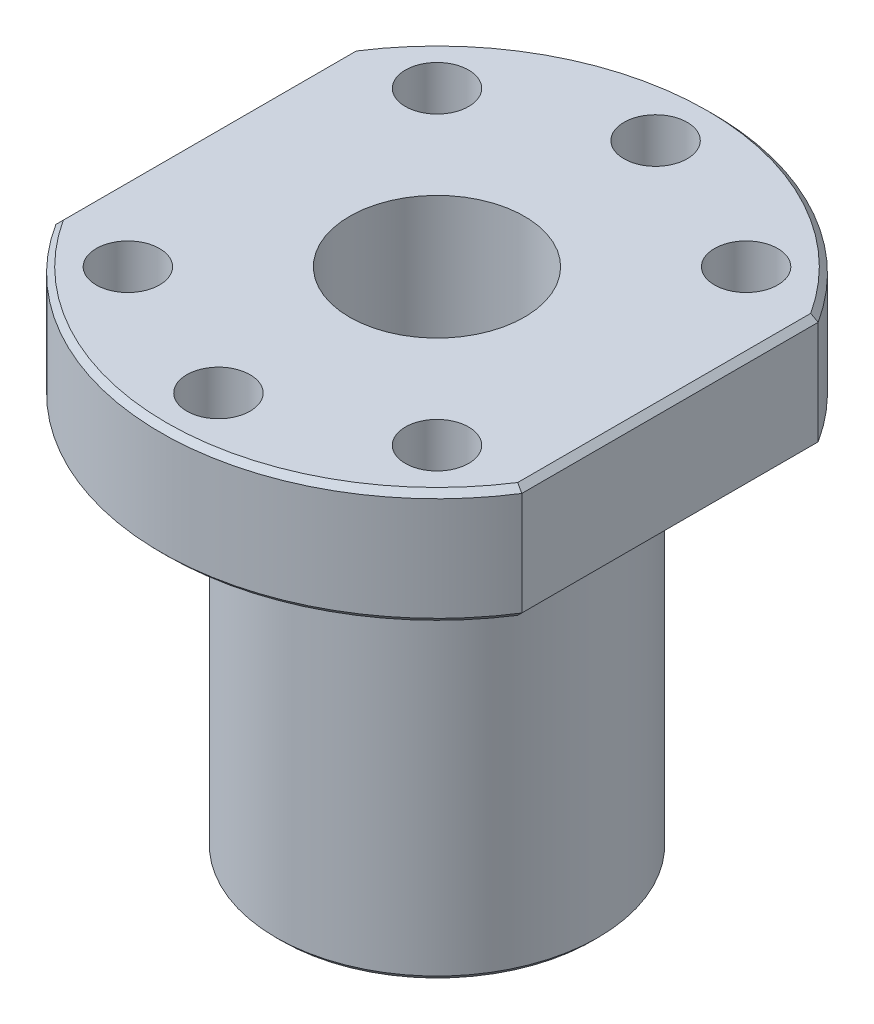
ISO-10303-21;
HEADER;
FILE_DESCRIPTION(('STEP AP214'),'2;1');
FILE_NAME('part.step','',(''),(''),'','','');
FILE_SCHEMA(('AUTOMOTIVE_DESIGN { 1 0 10303 214 1 1 1 1 }'));
ENDSEC;
DATA;
#1=APPLICATION_CONTEXT('core data for automotive mechanical design processes');
#2=APPLICATION_PROTOCOL_DEFINITION('international standard','automotive_design',2000,#1);
#3=PRODUCT_CONTEXT('',#1,'mechanical');
#4=PRODUCT('Part','Part','',(#3));
#5=PRODUCT_RELATED_PRODUCT_CATEGORY('part','',(#4));
#6=PRODUCT_DEFINITION_FORMATION('','',#4);
#7=PRODUCT_DEFINITION_CONTEXT('part definition',#1,'design');
#8=PRODUCT_DEFINITION('design','',#6,#7);
#9=PRODUCT_DEFINITION_SHAPE('','',#8);
#10=(LENGTH_UNIT() NAMED_UNIT(*) SI_UNIT(.MILLI.,.METRE.));
#11=(NAMED_UNIT(*) PLANE_ANGLE_UNIT() SI_UNIT($,.RADIAN.));
#12=(NAMED_UNIT(*) SI_UNIT($,.STERADIAN.) SOLID_ANGLE_UNIT());
#13=UNCERTAINTY_MEASURE_WITH_UNIT(LENGTH_MEASURE(1.E-05),#10,'distance_accuracy_value','');
#14=(GEOMETRIC_REPRESENTATION_CONTEXT(3) GLOBAL_UNCERTAINTY_ASSIGNED_CONTEXT((#13)) GLOBAL_UNIT_ASSIGNED_CONTEXT((#10,
#11,#12)) REPRESENTATION_CONTEXT('',''));
#15=CARTESIAN_POINT('',(0.,0.,0.));
#16=DIRECTION('',(0.,0.,1.));
#17=DIRECTION('',(1.,0.,0.));
#18=AXIS2_PLACEMENT_3D('',#15,#16,#17);
#19=CARTESIAN_POINT('',(0.,34.,0.));
#20=DIRECTION('',(0.,-1.,0.));
#21=DIRECTION('',(0.,0.,-1.));
#22=AXIS2_PLACEMENT_3D('',#19,#20,#21);
#23=CYLINDRICAL_SURFACE('',#22,14.);
#24=CARTESIAN_POINT('',(0.,0.5,0.));
#25=DIRECTION('',(0.,1.,0.));
#26=DIRECTION('',(0.,0.,1.));
#27=AXIS2_PLACEMENT_3D('',#24,#25,#26);
#28=CIRCLE('',#27,14.);
#29=CARTESIAN_POINT('',(0.,0.5,14.));
#30=VERTEX_POINT('',#29);
#31=EDGE_CURVE('E52',#30,#30,#28,.T.);
#32=ORIENTED_EDGE('',*,*,#31,.T.);
#33=EDGE_LOOP('',(#32));
#34=FACE_BOUND('',#33,.T.);
#35=CARTESIAN_POINT('',(0.,34.,0.));
#36=DIRECTION('',(0.,1.,0.));
#37=DIRECTION('',(0.,0.,1.));
#38=AXIS2_PLACEMENT_3D('',#35,#36,#37);
#39=CIRCLE('',#38,14.);
#40=CARTESIAN_POINT('',(0.,34.,14.));
#41=VERTEX_POINT('',#40);
#42=EDGE_CURVE('E140',#41,#41,#39,.T.);
#43=ORIENTED_EDGE('',*,*,#42,.F.);
#44=EDGE_LOOP('',(#43));
#45=FACE_BOUND('',#44,.T.);
#46=ADVANCED_FACE('F39',(#34,#45),#23,.T.);
#47=CARTESIAN_POINT('',(0.,0.,0.));
#48=DIRECTION('',(0.,1.,0.));
#49=DIRECTION('',(0.,0.,1.));
#50=AXIS2_PLACEMENT_3D('',#47,#48,#49);
#51=PLANE('',#50);
#52=CARTESIAN_POINT('',(0.,0.,0.));
#53=DIRECTION('',(0.,1.,0.));
#54=DIRECTION('',(0.,0.,1.));
#55=AXIS2_PLACEMENT_3D('',#52,#53,#54);
#56=CIRCLE('',#55,13.5);
#57=CARTESIAN_POINT('',(0.,0.,13.5));
#58=VERTEX_POINT('',#57);
#59=EDGE_CURVE('E11',#58,#58,#56,.F.);
#60=ORIENTED_EDGE('',*,*,#59,.T.);
#61=EDGE_LOOP('',(#60));
#62=FACE_BOUND('',#61,.T.);
#63=CARTESIAN_POINT('',(0.,0.,0.));
#64=DIRECTION('',(0.,1.,0.));
#65=DIRECTION('',(0.,0.,1.));
#66=AXIS2_PLACEMENT_3D('',#63,#64,#65);
#67=CIRCLE('',#66,7.6);
#68=CARTESIAN_POINT('',(0.,0.,7.6));
#69=VERTEX_POINT('',#68);
#70=EDGE_CURVE('E279',#69,#69,#67,.T.);
#71=ORIENTED_EDGE('',*,*,#70,.T.);
#72=EDGE_LOOP('',(#71));
#73=FACE_BOUND('',#72,.T.);
#74=ADVANCED_FACE('F213',(#62,#73),#51,.F.);
#75=CARTESIAN_POINT('',(0.,34.,0.));
#76=DIRECTION('',(0.,1.,0.));
#77=DIRECTION('',(0.,0.,1.));
#78=AXIS2_PLACEMENT_3D('',#75,#76,#77);
#79=PLANE('',#78);
#80=DIRECTION('',(0.,0.,1.));
#81=VECTOR('',#80,1.);
#82=CARTESIAN_POINT('',(19.75,34.,0.));
#83=LINE('',#82,#81);
#84=CARTESIAN_POINT('',(19.75,34.,-12.73528562695));
#85=VERTEX_POINT('',#84);
#86=CARTESIAN_POINT('',(19.75,34.,12.73528562695));
#87=VERTEX_POINT('',#86);
#88=EDGE_CURVE('E245',#85,#87,#83,.T.);
#89=ORIENTED_EDGE('',*,*,#88,.T.);
#90=CARTESIAN_POINT('',(0.,34.,0.));
#91=DIRECTION('',(0.,1.,0.));
#92=DIRECTION('',(0.,0.,1.));
#93=AXIS2_PLACEMENT_3D('',#90,#91,#92);
#94=CIRCLE('',#93,23.5);
#95=CARTESIAN_POINT('',(-19.75,34.,12.73528562695));
#96=VERTEX_POINT('',#95);
#97=EDGE_CURVE('E121',#87,#96,#94,.F.);
#98=ORIENTED_EDGE('',*,*,#97,.T.);
#99=DIRECTION('',(0.,0.,-1.));
#100=VECTOR('',#99,1.);
#101=CARTESIAN_POINT('',(-19.75,34.,0.));
#102=LINE('',#101,#100);
#103=CARTESIAN_POINT('',(-19.75,34.,-12.73528562695));
#104=VERTEX_POINT('',#103);
#105=EDGE_CURVE('E327',#96,#104,#102,.T.);
#106=ORIENTED_EDGE('',*,*,#105,.T.);
#107=CARTESIAN_POINT('',(0.,34.,0.));
#108=DIRECTION('',(0.,1.,0.));
#109=DIRECTION('',(0.,0.,1.));
#110=AXIS2_PLACEMENT_3D('',#107,#108,#109);
#111=CIRCLE('',#110,23.5);
#112=EDGE_CURVE('E249',#104,#85,#111,.F.);
#113=ORIENTED_EDGE('',*,*,#112,.T.);
#114=EDGE_LOOP('',(#89,#98,#106,#113));
#115=FACE_BOUND('',#114,.T.);
#116=CARTESIAN_POINT('',(-13.4350288425283,34.,-13.4350288425514));
#117=DIRECTION('',(0.,1.,0.));
#118=DIRECTION('',(0.,0.,1.));
#119=AXIS2_PLACEMENT_3D('',#116,#117,#118);
#120=CIRCLE('',#119,2.74999999998649);
#121=CARTESIAN_POINT('',(-13.4350288425283,34.,-10.6850288425649));
#122=VERTEX_POINT('',#121);
#123=EDGE_CURVE('E280',#122,#122,#120,.T.);
#124=ORIENTED_EDGE('',*,*,#123,.T.);
#125=EDGE_LOOP('',(#124));
#126=FACE_BOUND('',#125,.T.);
#127=CARTESIAN_POINT('',(7.47958179576635E-12,34.,19.));
#128=DIRECTION('',(0.,1.,0.));
#129=DIRECTION('',(0.,0.,1.));
#130=AXIS2_PLACEMENT_3D('',#127,#128,#129);
#131=CIRCLE('',#130,2.75000000000728);
#132=CARTESIAN_POINT('',(7.47958179576635E-12,34.,21.7500000000073));
#133=VERTEX_POINT('',#132);
#134=EDGE_CURVE('E294',#133,#133,#131,.T.);
#135=ORIENTED_EDGE('',*,*,#134,.T.);
#136=EDGE_LOOP('',(#135));
#137=FACE_BOUND('',#136,.T.);
#138=CARTESIAN_POINT('',(13.435028842549,34.,-13.435028842549));
#139=DIRECTION('',(0.,1.,0.));
#140=DIRECTION('',(0.,0.,1.));
#141=AXIS2_PLACEMENT_3D('',#138,#139,#140);
#142=CIRCLE('',#141,2.7499999999981);
#143=CARTESIAN_POINT('',(13.435028842549,34.,-10.6850288425509));
#144=VERTEX_POINT('',#143);
#145=EDGE_CURVE('E306',#144,#144,#142,.T.);
#146=ORIENTED_EDGE('',*,*,#145,.T.);
#147=EDGE_LOOP('',(#146));
#148=FACE_BOUND('',#147,.T.);
#149=CARTESIAN_POINT('',(0.,34.,-19.));
#150=DIRECTION('',(0.,1.,0.));
#151=DIRECTION('',(0.,0.,1.));
#152=AXIS2_PLACEMENT_3D('',#149,#150,#151);
#153=CIRCLE('',#152,2.75);
#154=CARTESIAN_POINT('',(0.,34.,-16.25));
#155=VERTEX_POINT('',#154);
#156=EDGE_CURVE('E312',#155,#155,#153,.T.);
#157=ORIENTED_EDGE('',*,*,#156,.T.);
#158=EDGE_LOOP('',(#157));
#159=FACE_BOUND('',#158,.T.);
#160=CARTESIAN_POINT('',(13.4350288425543,34.,13.4350288425437));
#161=DIRECTION('',(0.,1.,0.));
#162=DIRECTION('',(0.,0.,1.));
#163=AXIS2_PLACEMENT_3D('',#160,#161,#162);
#164=CIRCLE('',#163,2.75000000000538);
#165=CARTESIAN_POINT('',(13.4350288425543,34.,16.1850288425491));
#166=VERTEX_POINT('',#165);
#167=EDGE_CURVE('E300',#166,#166,#164,.T.);
#168=ORIENTED_EDGE('',*,*,#167,.T.);
#169=EDGE_LOOP('',(#168));
#170=FACE_BOUND('',#169,.T.);
#171=CARTESIAN_POINT('',(-13.4350288425383,34.,13.4350288425413));
#172=DIRECTION('',(0.,1.,0.));
#173=DIRECTION('',(0.,0.,1.));
#174=AXIS2_PLACEMENT_3D('',#171,#172,#173);
#175=CIRCLE('',#174,2.75000000000403);
#176=CARTESIAN_POINT('',(-13.4350288425383,34.,16.1850288425453));
#177=VERTEX_POINT('',#176);
#178=EDGE_CURVE('E289',#177,#177,#175,.T.);
#179=ORIENTED_EDGE('',*,*,#178,.T.);
#180=EDGE_LOOP('',(#179));
#181=FACE_BOUND('',#180,.T.);
#182=ORIENTED_EDGE('',*,*,#42,.T.);
#183=EDGE_LOOP('',(#182));
#184=FACE_BOUND('',#183,.T.);
#185=ADVANCED_FACE('F219',(#115,#126,#137,#148,#159,#170,#181,#184),#79,.F.);
#186=CARTESIAN_POINT('',(0.,44.,0.));
#187=DIRECTION('',(0.,1.,0.));
#188=DIRECTION('',(0.,0.,1.));
#189=AXIS2_PLACEMENT_3D('',#186,#187,#188);
#190=PLANE('',#189);
#191=DIRECTION('',(0.,0.,-1.));
#192=VECTOR('',#191,1.);
#193=CARTESIAN_POINT('',(19.75,44.,-12.8816730279882));
#194=LINE('',#193,#192);
#195=CARTESIAN_POINT('',(19.75,44.,12.73528562695));
#196=VERTEX_POINT('',#195);
#197=CARTESIAN_POINT('',(19.75,44.,-12.73528562695));
#198=VERTEX_POINT('',#197);
#199=EDGE_CURVE('E60',#196,#198,#194,.T.);
#200=ORIENTED_EDGE('',*,*,#199,.T.);
#201=CARTESIAN_POINT('',(0.,44.,0.));
#202=DIRECTION('',(0.,1.,0.));
#203=DIRECTION('',(0.,0.,1.));
#204=AXIS2_PLACEMENT_3D('',#201,#202,#203);
#205=CIRCLE('',#204,23.5);
#206=CARTESIAN_POINT('',(-19.75,44.,-12.73528562695));
#207=VERTEX_POINT('',#206);
#208=EDGE_CURVE('E268',#198,#207,#205,.T.);
#209=ORIENTED_EDGE('',*,*,#208,.T.);
#210=DIRECTION('',(0.,0.,1.));
#211=VECTOR('',#210,1.);
#212=CARTESIAN_POINT('',(-19.75,44.,12.8816730279882));
#213=LINE('',#212,#211);
#214=CARTESIAN_POINT('',(-19.75,44.,12.73528562695));
#215=VERTEX_POINT('',#214);
#216=EDGE_CURVE('E264',#207,#215,#213,.T.);
#217=ORIENTED_EDGE('',*,*,#216,.T.);
#218=CARTESIAN_POINT('',(0.,44.,0.));
#219=DIRECTION('',(0.,1.,0.));
#220=DIRECTION('',(0.,0.,1.));
#221=AXIS2_PLACEMENT_3D('',#218,#219,#220);
#222=CIRCLE('',#221,23.5);
#223=EDGE_CURVE('E65',#215,#196,#222,.T.);
#224=ORIENTED_EDGE('',*,*,#223,.T.);
#225=EDGE_LOOP('',(#200,#209,#217,#224));
#226=FACE_BOUND('',#225,.T.);
#227=CARTESIAN_POINT('',(0.,44.,0.));
#228=DIRECTION('',(0.,1.,0.));
#229=DIRECTION('',(0.,0.,1.));
#230=AXIS2_PLACEMENT_3D('',#227,#228,#229);
#231=CIRCLE('',#230,7.6);
#232=CARTESIAN_POINT('',(0.,44.,7.6));
#233=VERTEX_POINT('',#232);
#234=EDGE_CURVE('E186',#233,#233,#231,.T.);
#235=ORIENTED_EDGE('',*,*,#234,.F.);
#236=EDGE_LOOP('',(#235));
#237=FACE_BOUND('',#236,.T.);
#238=CARTESIAN_POINT('',(-13.4350288425383,44.,13.4350288425413));
#239=DIRECTION('',(0.,1.,0.));
#240=DIRECTION('',(0.,0.,1.));
#241=AXIS2_PLACEMENT_3D('',#238,#239,#240);
#242=CIRCLE('',#241,2.75000000000403);
#243=CARTESIAN_POINT('',(-13.4350288425383,44.,16.1850288425453));
#244=VERTEX_POINT('',#243);
#245=EDGE_CURVE('E291',#244,#244,#242,.T.);
#246=ORIENTED_EDGE('',*,*,#245,.F.);
#247=EDGE_LOOP('',(#246));
#248=FACE_BOUND('',#247,.T.);
#249=CARTESIAN_POINT('',(13.4350288425543,44.,13.4350288425437));
#250=DIRECTION('',(0.,1.,0.));
#251=DIRECTION('',(0.,0.,1.));
#252=AXIS2_PLACEMENT_3D('',#249,#250,#251);
#253=CIRCLE('',#252,2.75000000000538);
#254=CARTESIAN_POINT('',(13.4350288425543,44.,16.1850288425491));
#255=VERTEX_POINT('',#254);
#256=EDGE_CURVE('E303',#255,#255,#253,.T.);
#257=ORIENTED_EDGE('',*,*,#256,.F.);
#258=EDGE_LOOP('',(#257));
#259=FACE_BOUND('',#258,.T.);
#260=CARTESIAN_POINT('',(0.,44.,-19.));
#261=DIRECTION('',(0.,1.,0.));
#262=DIRECTION('',(0.,0.,1.));
#263=AXIS2_PLACEMENT_3D('',#260,#261,#262);
#264=CIRCLE('',#263,2.75);
#265=CARTESIAN_POINT('',(0.,44.,-16.25));
#266=VERTEX_POINT('',#265);
#267=EDGE_CURVE('E315',#266,#266,#264,.T.);
#268=ORIENTED_EDGE('',*,*,#267,.F.);
#269=EDGE_LOOP('',(#268));
#270=FACE_BOUND('',#269,.T.);
#271=CARTESIAN_POINT('',(13.435028842549,44.,-13.435028842549));
#272=DIRECTION('',(0.,1.,0.));
#273=DIRECTION('',(0.,0.,1.));
#274=AXIS2_PLACEMENT_3D('',#271,#272,#273);
#275=CIRCLE('',#274,2.7499999999981);
#276=CARTESIAN_POINT('',(13.435028842549,44.,-10.6850288425509));
#277=VERTEX_POINT('',#276);
#278=EDGE_CURVE('E309',#277,#277,#275,.T.);
#279=ORIENTED_EDGE('',*,*,#278,.F.);
#280=EDGE_LOOP('',(#279));
#281=FACE_BOUND('',#280,.T.);
#282=CARTESIAN_POINT('',(7.47958179576635E-12,44.,19.));
#283=DIRECTION('',(0.,1.,0.));
#284=DIRECTION('',(0.,0.,1.));
#285=AXIS2_PLACEMENT_3D('',#282,#283,#284);
#286=CIRCLE('',#285,2.75000000000728);
#287=CARTESIAN_POINT('',(7.47958179576635E-12,44.,21.7500000000073));
#288=VERTEX_POINT('',#287);
#289=EDGE_CURVE('E297',#288,#288,#286,.T.);
#290=ORIENTED_EDGE('',*,*,#289,.F.);
#291=EDGE_LOOP('',(#290));
#292=FACE_BOUND('',#291,.T.);
#293=CARTESIAN_POINT('',(-13.4350288425283,44.,-13.4350288425514));
#294=DIRECTION('',(0.,1.,0.));
#295=DIRECTION('',(0.,0.,1.));
#296=AXIS2_PLACEMENT_3D('',#293,#294,#295);
#297=CIRCLE('',#296,2.74999999998649);
#298=CARTESIAN_POINT('',(-13.4350288425283,44.,-10.6850288425649));
#299=VERTEX_POINT('',#298);
#300=EDGE_CURVE('E283',#299,#299,#297,.T.);
#301=ORIENTED_EDGE('',*,*,#300,.F.);
#302=EDGE_LOOP('',(#301));
#303=FACE_BOUND('',#302,.T.);
#304=ADVANCED_FACE('F336',(#226,#237,#248,#259,#270,#281,#292,#303),#190,.T.);
#305=CARTESIAN_POINT('',(0.,44.,0.));
#306=DIRECTION('',(0.,-1.,0.));
#307=DIRECTION('',(0.,0.,-1.));
#308=AXIS2_PLACEMENT_3D('',#305,#306,#307);
#309=CYLINDRICAL_SURFACE('',#308,24.);
#310=DIRECTION('',(0.,-1.,0.));
#311=VECTOR('',#310,1.);
#312=CARTESIAN_POINT('',(20.25,44.,-12.8816730279882));
#313=LINE('',#312,#311);
#314=CARTESIAN_POINT('',(20.25,43.5,-12.8816730279882));
#315=VERTEX_POINT('',#314);
#316=CARTESIAN_POINT('',(20.25,34.5,-12.8816730279882));
#317=VERTEX_POINT('',#316);
#318=EDGE_CURVE('E116',#315,#317,#313,.T.);
#319=ORIENTED_EDGE('',*,*,#318,.T.);
#320=CARTESIAN_POINT('',(0.,34.5,0.));
#321=DIRECTION('',(0.,1.,0.));
#322=DIRECTION('',(0.,0.,1.));
#323=AXIS2_PLACEMENT_3D('',#320,#321,#322);
#324=CIRCLE('',#323,24.);
#325=CARTESIAN_POINT('',(-20.25,34.5,-12.8816730279883));
#326=VERTEX_POINT('',#325);
#327=EDGE_CURVE('E250',#317,#326,#324,.T.);
#328=ORIENTED_EDGE('',*,*,#327,.T.);
#329=DIRECTION('',(0.,-1.,0.));
#330=VECTOR('',#329,1.);
#331=CARTESIAN_POINT('',(-20.25,44.,-12.8816730279883));
#332=LINE('',#331,#330);
#333=CARTESIAN_POINT('',(-20.25,43.5,-12.8816730279883));
#334=VERTEX_POINT('',#333);
#335=EDGE_CURVE('E322',#334,#326,#332,.T.);
#336=ORIENTED_EDGE('',*,*,#335,.F.);
#337=CARTESIAN_POINT('',(0.,43.5,0.));
#338=DIRECTION('',(0.,1.,0.));
#339=DIRECTION('',(0.,0.,1.));
#340=AXIS2_PLACEMENT_3D('',#337,#338,#339);
#341=CIRCLE('',#340,24.);
#342=EDGE_CURVE('E256',#334,#315,#341,.F.);
#343=ORIENTED_EDGE('',*,*,#342,.T.);
#344=EDGE_LOOP('',(#319,#328,#336,#343));
#345=FACE_BOUND('',#344,.T.);
#346=ADVANCED_FACE('F332',(#345),#309,.T.);
#347=CARTESIAN_POINT('',(-20.25,44.,12.8816730279882));
#348=DIRECTION('',(1.,0.,0.));
#349=DIRECTION('',(0.,0.,-1.));
#350=AXIS2_PLACEMENT_3D('',#347,#348,#349);
#351=PLANE('',#350);
#352=ORIENTED_EDGE('',*,*,#335,.T.);
#353=DIRECTION('',(0.,0.,1.));
#354=VECTOR('',#353,1.);
#355=CARTESIAN_POINT('',(-20.25,34.5,12.8816730279882));
#356=LINE('',#355,#354);
#357=CARTESIAN_POINT('',(-20.25,34.5,12.8816730279882));
#358=VERTEX_POINT('',#357);
#359=EDGE_CURVE('E258',#326,#358,#356,.T.);
#360=ORIENTED_EDGE('',*,*,#359,.T.);
#361=DIRECTION('',(0.,-1.,0.));
#362=VECTOR('',#361,1.);
#363=CARTESIAN_POINT('',(-20.25,44.,12.8816730279882));
#364=LINE('',#363,#362);
#365=CARTESIAN_POINT('',(-20.25,43.5,12.8816730279882));
#366=VERTEX_POINT('',#365);
#367=EDGE_CURVE('E132',#366,#358,#364,.T.);
#368=ORIENTED_EDGE('',*,*,#367,.F.);
#369=DIRECTION('',(0.,0.,-1.));
#370=VECTOR('',#369,1.);
#371=CARTESIAN_POINT('',(-20.25,43.5,-12.8816730279883));
#372=LINE('',#371,#370);
#373=EDGE_CURVE('E255',#366,#334,#372,.T.);
#374=ORIENTED_EDGE('',*,*,#373,.T.);
#375=EDGE_LOOP('',(#352,#360,#368,#374));
#376=FACE_BOUND('',#375,.T.);
#377=ADVANCED_FACE('F402',(#376),#351,.F.);
#378=CARTESIAN_POINT('',(0.,44.,0.));
#379=DIRECTION('',(0.,-1.,0.));
#380=DIRECTION('',(0.,0.,-1.));
#381=AXIS2_PLACEMENT_3D('',#378,#379,#380);
#382=CYLINDRICAL_SURFACE('',#381,24.);
#383=ORIENTED_EDGE('',*,*,#367,.T.);
#384=CARTESIAN_POINT('',(0.,34.5,0.));
#385=DIRECTION('',(0.,1.,0.));
#386=DIRECTION('',(0.,0.,1.));
#387=AXIS2_PLACEMENT_3D('',#384,#385,#386);
#388=CIRCLE('',#387,24.);
#389=CARTESIAN_POINT('',(20.25,34.5,12.8816730279882));
#390=VERTEX_POINT('',#389);
#391=EDGE_CURVE('E131',#358,#390,#388,.T.);
#392=ORIENTED_EDGE('',*,*,#391,.T.);
#393=DIRECTION('',(0.,-1.,0.));
#394=VECTOR('',#393,1.);
#395=CARTESIAN_POINT('',(20.25,44.,12.8816730279882));
#396=LINE('',#395,#394);
#397=CARTESIAN_POINT('',(20.25,43.5,12.8816730279882));
#398=VERTEX_POINT('',#397);
#399=EDGE_CURVE('E114',#398,#390,#396,.T.);
#400=ORIENTED_EDGE('',*,*,#399,.F.);
#401=CARTESIAN_POINT('',(0.,43.5,0.));
#402=DIRECTION('',(0.,1.,0.));
#403=DIRECTION('',(0.,0.,1.));
#404=AXIS2_PLACEMENT_3D('',#401,#402,#403);
#405=CIRCLE('',#404,24.);
#406=EDGE_CURVE('E128',#398,#366,#405,.F.);
#407=ORIENTED_EDGE('',*,*,#406,.T.);
#408=EDGE_LOOP('',(#383,#392,#400,#407));
#409=FACE_BOUND('',#408,.T.);
#410=ADVANCED_FACE('F127',(#409),#382,.T.);
#411=CARTESIAN_POINT('',(20.25,44.,12.8816730279882));
#412=DIRECTION('',(-1.,0.,0.));
#413=DIRECTION('',(0.,0.,1.));
#414=AXIS2_PLACEMENT_3D('',#411,#412,#413);
#415=PLANE('',#414);
#416=ORIENTED_EDGE('',*,*,#399,.T.);
#417=DIRECTION('',(0.,0.,-1.));
#418=VECTOR('',#417,1.);
#419=CARTESIAN_POINT('',(20.25,34.5,12.8816730279882));
#420=LINE('',#419,#418);
#421=EDGE_CURVE('E120',#390,#317,#420,.T.);
#422=ORIENTED_EDGE('',*,*,#421,.T.);
#423=ORIENTED_EDGE('',*,*,#318,.F.);
#424=DIRECTION('',(0.,0.,1.));
#425=VECTOR('',#424,1.);
#426=CARTESIAN_POINT('',(20.25,43.5,12.8816730279882));
#427=LINE('',#426,#425);
#428=EDGE_CURVE('E111',#315,#398,#427,.T.);
#429=ORIENTED_EDGE('',*,*,#428,.T.);
#430=EDGE_LOOP('',(#416,#422,#423,#429));
#431=FACE_BOUND('',#430,.T.);
#432=ADVANCED_FACE('F113',(#431),#415,.F.);
#433=CARTESIAN_POINT('',(0.,44.,-19.));
#434=DIRECTION('',(0.,-1.,0.));
#435=DIRECTION('',(0.,0.,-1.));
#436=AXIS2_PLACEMENT_3D('',#433,#434,#435);
#437=CYLINDRICAL_SURFACE('',#436,2.75);
#438=ORIENTED_EDGE('',*,*,#267,.T.);
#439=EDGE_LOOP('',(#438));
#440=FACE_BOUND('',#439,.T.);
#441=ORIENTED_EDGE('',*,*,#156,.F.);
#442=EDGE_LOOP('',(#441));
#443=FACE_BOUND('',#442,.T.);
#444=ADVANCED_FACE('F393',(#440,#443),#437,.F.);
#445=CARTESIAN_POINT('',(13.435028842549,44.,-13.435028842549));
#446=DIRECTION('',(0.,-1.,0.));
#447=DIRECTION('',(0.,0.,-1.));
#448=AXIS2_PLACEMENT_3D('',#445,#446,#447);
#449=CYLINDRICAL_SURFACE('',#448,2.7499999999981);
#450=ORIENTED_EDGE('',*,*,#278,.T.);
#451=EDGE_LOOP('',(#450));
#452=FACE_BOUND('',#451,.T.);
#453=ORIENTED_EDGE('',*,*,#145,.F.);
#454=EDGE_LOOP('',(#453));
#455=FACE_BOUND('',#454,.T.);
#456=ADVANCED_FACE('F389',(#452,#455),#449,.F.);
#457=CARTESIAN_POINT('',(13.4350288425543,44.,13.4350288425437));
#458=DIRECTION('',(0.,-1.,0.));
#459=DIRECTION('',(0.,0.,-1.));
#460=AXIS2_PLACEMENT_3D('',#457,#458,#459);
#461=CYLINDRICAL_SURFACE('',#460,2.75000000000538);
#462=ORIENTED_EDGE('',*,*,#256,.T.);
#463=EDGE_LOOP('',(#462));
#464=FACE_BOUND('',#463,.T.);
#465=ORIENTED_EDGE('',*,*,#167,.F.);
#466=EDGE_LOOP('',(#465));
#467=FACE_BOUND('',#466,.T.);
#468=ADVANCED_FACE('F383',(#464,#467),#461,.F.);
#469=CARTESIAN_POINT('',(7.47958179576635E-12,44.,19.));
#470=DIRECTION('',(0.,-1.,0.));
#471=DIRECTION('',(0.,0.,-1.));
#472=AXIS2_PLACEMENT_3D('',#469,#470,#471);
#473=CYLINDRICAL_SURFACE('',#472,2.75000000000728);
#474=ORIENTED_EDGE('',*,*,#289,.T.);
#475=EDGE_LOOP('',(#474));
#476=FACE_BOUND('',#475,.T.);
#477=ORIENTED_EDGE('',*,*,#134,.F.);
#478=EDGE_LOOP('',(#477));
#479=FACE_BOUND('',#478,.T.);
#480=ADVANCED_FACE('F377',(#476,#479),#473,.F.);
#481=CARTESIAN_POINT('',(-13.4350288425383,44.,13.4350288425413));
#482=DIRECTION('',(0.,-1.,0.));
#483=DIRECTION('',(0.,0.,-1.));
#484=AXIS2_PLACEMENT_3D('',#481,#482,#483);
#485=CYLINDRICAL_SURFACE('',#484,2.75000000000403);
#486=ORIENTED_EDGE('',*,*,#245,.T.);
#487=EDGE_LOOP('',(#486));
#488=FACE_BOUND('',#487,.T.);
#489=ORIENTED_EDGE('',*,*,#178,.F.);
#490=EDGE_LOOP('',(#489));
#491=FACE_BOUND('',#490,.T.);
#492=ADVANCED_FACE('F356',(#488,#491),#485,.F.);
#493=CARTESIAN_POINT('',(-13.4350288425283,44.,-13.4350288425514));
#494=DIRECTION('',(0.,-1.,0.));
#495=DIRECTION('',(0.,0.,-1.));
#496=AXIS2_PLACEMENT_3D('',#493,#494,#495);
#497=CYLINDRICAL_SURFACE('',#496,2.74999999998649);
#498=ORIENTED_EDGE('',*,*,#300,.T.);
#499=EDGE_LOOP('',(#498));
#500=FACE_BOUND('',#499,.T.);
#501=ORIENTED_EDGE('',*,*,#123,.F.);
#502=EDGE_LOOP('',(#501));
#503=FACE_BOUND('',#502,.T.);
#504=ADVANCED_FACE('F208',(#500,#503),#497,.F.);
#505=CARTESIAN_POINT('',(0.,0.,0.));
#506=DIRECTION('',(0.,1.,0.));
#507=DIRECTION('',(0.,0.,1.));
#508=AXIS2_PLACEMENT_3D('',#505,#506,#507);
#509=CYLINDRICAL_SURFACE('',#508,7.6);
#510=ORIENTED_EDGE('',*,*,#70,.F.);
#511=EDGE_LOOP('',(#510));
#512=FACE_BOUND('',#511,.T.);
#513=ORIENTED_EDGE('',*,*,#234,.T.);
#514=EDGE_LOOP('',(#513));
#515=FACE_BOUND('',#514,.T.);
#516=ADVANCED_FACE('F199',(#512,#515),#509,.F.);
#517=CARTESIAN_POINT('',(0.,34.5,0.));
#518=DIRECTION('',(0.,1.,0.));
#519=DIRECTION('',(0.,0.,1.));
#520=AXIS2_PLACEMENT_3D('',#517,#518,#519);
#521=CONICAL_SURFACE('',#520,24.,0.785398163397448);
#522=CARTESIAN_POINT('',(20.25,34.5,-12.8816730279882));
#523=CARTESIAN_POINT('',(20.1666470962478,34.4166470962478,-12.8574088190556));
#524=CARTESIAN_POINT('',(20.083303977846,34.333303977846,-12.8330777645443));
#525=CARTESIAN_POINT('',(19.9166373111792,34.1666373111792,-12.7842819641991));
#526=CARTESIAN_POINT('',(19.8333137629143,34.0833137629143,-12.7598172183643));
#527=CARTESIAN_POINT('',(19.75,34.,-12.73528562695));
#528=B_SPLINE_CURVE_WITH_KNOTS('',3,(#522,#523,#524,#525,#526,#527),.UNSPECIFIED.,.F.,.F.,(4,2,
4),(0.,0.361050355007855,0.722100712461135),.UNSPECIFIED.);
#529=EDGE_CURVE('E187',#85,#317,#528,.F.);
#530=ORIENTED_EDGE('',*,*,#529,.F.);
#531=ORIENTED_EDGE('',*,*,#112,.F.);
#532=CARTESIAN_POINT('',(-20.25,34.5,-12.8816730279883));
#533=CARTESIAN_POINT('',(-20.1666470962477,34.4166470962478,-12.8574088190556));
#534=CARTESIAN_POINT('',(-20.083303977846,34.333303977846,-12.8330777645443));
#535=CARTESIAN_POINT('',(-19.9166373111792,34.1666373111792,-12.7842819641991));
#536=CARTESIAN_POINT('',(-19.8333137629143,34.0833137629143,-12.7598172183643));
#537=CARTESIAN_POINT('',(-19.75,34.,-12.73528562695));
#538=B_SPLINE_CURVE_WITH_KNOTS('',3,(#532,#533,#534,#535,#536,#537),.UNSPECIFIED.,.F.,.F.,(4,2,
4),(0.,0.361050355007855,0.722100712461136),.UNSPECIFIED.);
#539=EDGE_CURVE('E179',#326,#104,#538,.T.);
#540=ORIENTED_EDGE('',*,*,#539,.F.);
#541=ORIENTED_EDGE('',*,*,#327,.F.);
#542=EDGE_LOOP('',(#530,#531,#540,#541));
#543=FACE_BOUND('',#542,.T.);
#544=ADVANCED_FACE('F196',(#543),#521,.T.);
#545=CARTESIAN_POINT('',(-20.25,34.5,12.8816730279882));
#546=DIRECTION('',(0.707106781186547,0.707106781186547,0.));
#547=DIRECTION('',(0.,0.,1.));
#548=AXIS2_PLACEMENT_3D('',#545,#546,#547);
#549=PLANE('',#548);
#550=ORIENTED_EDGE('',*,*,#539,.T.);
#551=ORIENTED_EDGE('',*,*,#105,.F.);
#552=CARTESIAN_POINT('',(-19.75,34.,12.73528562695));
#553=CARTESIAN_POINT('',(-19.8333137629143,34.0833137629143,12.7598172183643));
#554=CARTESIAN_POINT('',(-19.9166373111792,34.1666373111792,12.7842819641991));
#555=CARTESIAN_POINT('',(-20.083303977846,34.333303977846,12.8330777645443));
#556=CARTESIAN_POINT('',(-20.1666470962478,34.4166470962478,12.8574088190556));
#557=CARTESIAN_POINT('',(-20.25,34.5,12.8816730279882));
#558=B_SPLINE_CURVE_WITH_KNOTS('',3,(#552,#553,#554,#555,#556,#557),.UNSPECIFIED.,.F.,.F.,(4,2,
4),(0.,0.361050357453281,0.722100712461137),.UNSPECIFIED.);
#559=EDGE_CURVE('E144',#358,#96,#558,.F.);
#560=ORIENTED_EDGE('',*,*,#559,.F.);
#561=ORIENTED_EDGE('',*,*,#359,.F.);
#562=EDGE_LOOP('',(#550,#551,#560,#561));
#563=FACE_BOUND('',#562,.T.);
#564=ADVANCED_FACE('F193',(#563),#549,.F.);
#565=CARTESIAN_POINT('',(20.25,34.5,12.8816730279882));
#566=DIRECTION('',(-0.707106781186547,0.707106781186547,0.));
#567=DIRECTION('',(0.,0.,-1.));
#568=AXIS2_PLACEMENT_3D('',#565,#566,#567);
#569=PLANE('',#568);
#570=ORIENTED_EDGE('',*,*,#529,.T.);
#571=ORIENTED_EDGE('',*,*,#421,.F.);
#572=CARTESIAN_POINT('',(20.25,34.5,12.8816730279882));
#573=CARTESIAN_POINT('',(20.1666470962478,34.4166470962478,12.8574088190556));
#574=CARTESIAN_POINT('',(20.083303977846,34.333303977846,12.8330777645443));
#575=CARTESIAN_POINT('',(19.9166373111792,34.1666373111792,12.7842819641991));
#576=CARTESIAN_POINT('',(19.8333137629143,34.0833137629143,12.7598172183643));
#577=CARTESIAN_POINT('',(19.75,34.,12.73528562695));
#578=B_SPLINE_CURVE_WITH_KNOTS('',3,(#572,#573,#574,#575,#576,#577),.UNSPECIFIED.,.F.,.F.,(4,2,
4),(0.,0.361050355007857,0.72210071246114),.UNSPECIFIED.);
#579=EDGE_CURVE('E143',#87,#390,#578,.F.);
#580=ORIENTED_EDGE('',*,*,#579,.F.);
#581=ORIENTED_EDGE('',*,*,#88,.F.);
#582=EDGE_LOOP('',(#570,#571,#580,#581));
#583=FACE_BOUND('',#582,.T.);
#584=ADVANCED_FACE('F206',(#583),#569,.F.);
#585=CARTESIAN_POINT('',(0.,34.5,0.));
#586=DIRECTION('',(0.,1.,0.));
#587=DIRECTION('',(0.,0.,1.));
#588=AXIS2_PLACEMENT_3D('',#585,#586,#587);
#589=CONICAL_SURFACE('',#588,24.,0.785398163397448);
#590=ORIENTED_EDGE('',*,*,#559,.T.);
#591=ORIENTED_EDGE('',*,*,#97,.F.);
#592=ORIENTED_EDGE('',*,*,#579,.T.);
#593=ORIENTED_EDGE('',*,*,#391,.F.);
#594=EDGE_LOOP('',(#590,#591,#592,#593));
#595=FACE_BOUND('',#594,.T.);
#596=ADVANCED_FACE('F165',(#595),#589,.T.);
#597=CARTESIAN_POINT('',(0.,44.,0.));
#598=DIRECTION('',(0.,-1.,0.));
#599=DIRECTION('',(0.,0.,-1.));
#600=AXIS2_PLACEMENT_3D('',#597,#598,#599);
#601=CONICAL_SURFACE('',#600,23.5,0.785398163397441);
#602=CARTESIAN_POINT('',(-20.25,43.5,12.8816730279882));
#603=CARTESIAN_POINT('',(-20.1666470962478,43.5833529037522,12.8574088190556));
#604=CARTESIAN_POINT('',(-20.083303977846,43.666696022154,12.8330777645443));
#605=CARTESIAN_POINT('',(-19.9166373111792,43.8333626888208,12.7842819641991));
#606=CARTESIAN_POINT('',(-19.8333137629143,43.9166862370857,12.7598172183643));
#607=CARTESIAN_POINT('',(-19.75,44.,12.73528562695));
#608=B_SPLINE_CURVE_WITH_KNOTS('',3,(#602,#603,#604,#605,#606,#607),.UNSPECIFIED.,.F.,.F.,(4,2,
4),(0.,0.361050355007852,0.722100712461133),.UNSPECIFIED.);
#609=EDGE_CURVE('E138',#366,#215,#608,.T.);
#610=ORIENTED_EDGE('',*,*,#609,.F.);
#611=ORIENTED_EDGE('',*,*,#406,.F.);
#612=CARTESIAN_POINT('',(20.25,43.5,12.8816730279882));
#613=CARTESIAN_POINT('',(20.1666470962478,43.5833529037522,12.8574088190556));
#614=CARTESIAN_POINT('',(20.083303977846,43.666696022154,12.8330777645443));
#615=CARTESIAN_POINT('',(19.9166373111792,43.8333626888208,12.7842819641991));
#616=CARTESIAN_POINT('',(19.8333137629143,43.9166862370857,12.7598172183643));
#617=CARTESIAN_POINT('',(19.75,44.,12.73528562695));
#618=B_SPLINE_CURVE_WITH_KNOTS('',3,(#612,#613,#614,#615,#616,#617),.UNSPECIFIED.,.F.,.F.,(4,2,
4),(0.,0.361050355007855,0.722100712461136),.UNSPECIFIED.);
#619=EDGE_CURVE('E43',#196,#398,#618,.F.);
#620=ORIENTED_EDGE('',*,*,#619,.F.);
#621=ORIENTED_EDGE('',*,*,#223,.F.);
#622=EDGE_LOOP('',(#610,#611,#620,#621));
#623=FACE_BOUND('',#622,.T.);
#624=ADVANCED_FACE('F136',(#623),#601,.T.);
#625=CARTESIAN_POINT('',(19.75,44.,0.));
#626=DIRECTION('',(0.707106781186552,0.707106781186543,0.));
#627=DIRECTION('',(0.,0.,1.));
#628=AXIS2_PLACEMENT_3D('',#625,#626,#627);
#629=PLANE('',#628);
#630=ORIENTED_EDGE('',*,*,#619,.T.);
#631=ORIENTED_EDGE('',*,*,#428,.F.);
#632=CARTESIAN_POINT('',(20.25,43.5,-12.8816730279882));
#633=CARTESIAN_POINT('',(20.1666470962478,43.5833529037522,-12.8574088190556));
#634=CARTESIAN_POINT('',(20.083303977846,43.666696022154,-12.8330777645443));
#635=CARTESIAN_POINT('',(19.9166373111792,43.8333626888208,-12.7842819641991));
#636=CARTESIAN_POINT('',(19.8333137629143,43.9166862370857,-12.7598172183643));
#637=CARTESIAN_POINT('',(19.75,44.,-12.73528562695));
#638=B_SPLINE_CURVE_WITH_KNOTS('',3,(#632,#633,#634,#635,#636,#637),.UNSPECIFIED.,.F.,.F.,(4,2,
4),(0.,0.361050355007854,0.722100712461135),.UNSPECIFIED.);
#639=EDGE_CURVE('E146',#198,#315,#638,.F.);
#640=ORIENTED_EDGE('',*,*,#639,.F.);
#641=ORIENTED_EDGE('',*,*,#199,.F.);
#642=EDGE_LOOP('',(#630,#631,#640,#641));
#643=FACE_BOUND('',#642,.T.);
#644=ADVANCED_FACE('F142',(#643),#629,.T.);
#645=CARTESIAN_POINT('',(-19.75,44.,0.));
#646=DIRECTION('',(-0.707106781186552,0.707106781186543,0.));
#647=DIRECTION('',(0.,0.,-1.));
#648=AXIS2_PLACEMENT_3D('',#645,#646,#647);
#649=PLANE('',#648);
#650=ORIENTED_EDGE('',*,*,#609,.T.);
#651=ORIENTED_EDGE('',*,*,#216,.F.);
#652=CARTESIAN_POINT('',(-19.75,44.,-12.73528562695));
#653=CARTESIAN_POINT('',(-19.8333137629143,43.9166862370857,-12.7598172183643));
#654=CARTESIAN_POINT('',(-19.9166373111792,43.8333626888208,-12.7842819641991));
#655=CARTESIAN_POINT('',(-20.083303977846,43.666696022154,-12.8330777645443));
#656=CARTESIAN_POINT('',(-20.1666470962478,43.5833529037522,-12.8574088190556));
#657=CARTESIAN_POINT('',(-20.25,43.5,-12.8816730279883));
#658=B_SPLINE_CURVE_WITH_KNOTS('',3,(#652,#653,#654,#655,#656,#657),.UNSPECIFIED.,.F.,.F.,(4,2,
4),(0.,0.361050357453279,0.722100712461131),.UNSPECIFIED.);
#659=EDGE_CURVE('E149',#334,#207,#658,.F.);
#660=ORIENTED_EDGE('',*,*,#659,.F.);
#661=ORIENTED_EDGE('',*,*,#373,.F.);
#662=EDGE_LOOP('',(#650,#651,#660,#661));
#663=FACE_BOUND('',#662,.T.);
#664=ADVANCED_FACE('F160',(#663),#649,.T.);
#665=CARTESIAN_POINT('',(0.,44.,0.));
#666=DIRECTION('',(0.,-1.,0.));
#667=DIRECTION('',(0.,0.,-1.));
#668=AXIS2_PLACEMENT_3D('',#665,#666,#667);
#669=CONICAL_SURFACE('',#668,23.5,0.785398163397441);
#670=ORIENTED_EDGE('',*,*,#639,.T.);
#671=ORIENTED_EDGE('',*,*,#342,.F.);
#672=ORIENTED_EDGE('',*,*,#659,.T.);
#673=ORIENTED_EDGE('',*,*,#208,.F.);
#674=EDGE_LOOP('',(#670,#671,#672,#673));
#675=FACE_BOUND('',#674,.T.);
#676=ADVANCED_FACE('F169',(#675),#669,.T.);
#677=CARTESIAN_POINT('',(0.,0.5,0.));
#678=DIRECTION('',(0.,1.,0.));
#679=DIRECTION('',(0.,0.,1.));
#680=AXIS2_PLACEMENT_3D('',#677,#678,#679);
#681=CONICAL_SURFACE('',#680,14.,0.785398163397452);
#682=ORIENTED_EDGE('',*,*,#59,.F.);
#683=EDGE_LOOP('',(#682));
#684=FACE_BOUND('',#683,.T.);
#685=ORIENTED_EDGE('',*,*,#31,.F.);
#686=EDGE_LOOP('',(#685));
#687=FACE_BOUND('',#686,.T.);
#688=ADVANCED_FACE('F41',(#684,#687),#681,.T.);
#689=CLOSED_SHELL('',(#46,#74,#185,#304,#346,#377,#410,#432,#444,#456,#468,#480,#492,#504,#516,
#544,#564,#584,#596,#624,#644,#664,#676,#688));
#690=MANIFOLD_SOLID_BREP('B2',#689);
#691=ADVANCED_BREP_SHAPE_REPRESENTATION('',(#18,#690),#14);
#692=SHAPE_DEFINITION_REPRESENTATION(#9,#691);
ENDSEC;
END-ISO-10303-21;
